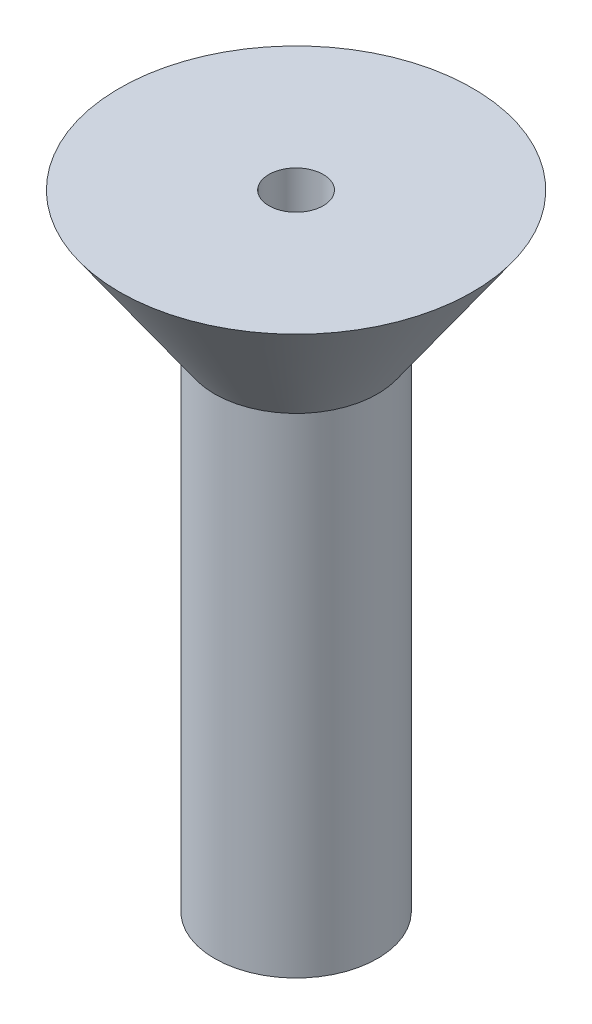
ISO-10303-21;
HEADER;
FILE_DESCRIPTION(('STEP AP214'),'2;1');
FILE_NAME('part.step','',(''),(''),'','','');
FILE_SCHEMA(('AUTOMOTIVE_DESIGN { 1 0 10303 214 1 1 1 1 }'));
ENDSEC;
DATA;
#1=APPLICATION_CONTEXT('core data for automotive mechanical design processes');
#2=APPLICATION_PROTOCOL_DEFINITION('international standard','automotive_design',2000,#1);
#3=PRODUCT_CONTEXT('',#1,'mechanical');
#4=PRODUCT('Part','Part','',(#3));
#5=PRODUCT_RELATED_PRODUCT_CATEGORY('part','',(#4));
#6=PRODUCT_DEFINITION_FORMATION('','',#4);
#7=PRODUCT_DEFINITION_CONTEXT('part definition',#1,'design');
#8=PRODUCT_DEFINITION('design','',#6,#7);
#9=PRODUCT_DEFINITION_SHAPE('','',#8);
#10=(LENGTH_UNIT() NAMED_UNIT(*) SI_UNIT(.MILLI.,.METRE.));
#11=(NAMED_UNIT(*) PLANE_ANGLE_UNIT() SI_UNIT($,.RADIAN.));
#12=(NAMED_UNIT(*) SI_UNIT($,.STERADIAN.) SOLID_ANGLE_UNIT());
#13=UNCERTAINTY_MEASURE_WITH_UNIT(LENGTH_MEASURE(1.E-05),#10,'distance_accuracy_value','');
#14=(GEOMETRIC_REPRESENTATION_CONTEXT(3) GLOBAL_UNCERTAINTY_ASSIGNED_CONTEXT((#13)) GLOBAL_UNIT_ASSIGNED_CONTEXT((#10,
#11,#12)) REPRESENTATION_CONTEXT('',''));
#15=CARTESIAN_POINT('',(0.,0.,0.));
#16=DIRECTION('',(0.,0.,1.));
#17=DIRECTION('',(1.,0.,0.));
#18=AXIS2_PLACEMENT_3D('',#15,#16,#17);
#19=CARTESIAN_POINT('',(0.,21.,0.));
#20=DIRECTION('',(0.,-1.,0.));
#21=DIRECTION('',(0.,0.,-1.));
#22=AXIS2_PLACEMENT_3D('',#19,#20,#21);
#23=PLANE('',#22);
#24=CARTESIAN_POINT('',(0.,21.,0.));
#25=DIRECTION('',(0.,1.,0.));
#26=DIRECTION('',(0.,0.,1.));
#27=AXIS2_PLACEMENT_3D('',#24,#25,#26);
#28=CIRCLE('',#27,0.999999999999991);
#29=CARTESIAN_POINT('',(0.,21.,0.999999999999991));
#30=VERTEX_POINT('',#29);
#31=EDGE_CURVE('E11',#30,#30,#28,.T.);
#32=ORIENTED_EDGE('',*,*,#31,.T.);
#33=EDGE_LOOP('',(#32));
#34=FACE_BOUND('',#33,.T.);
#35=ADVANCED_FACE('F44',(#34),#23,.F.);
#36=CARTESIAN_POINT('',(0.,91.9213442846911,0.));
#37=DIRECTION('',(0.,1.,0.));
#38=DIRECTION('',(0.,0.,1.));
#39=AXIS2_PLACEMENT_3D('',#36,#37,#38);
#40=CYLINDRICAL_SURFACE('',#39,0.999999999999991);
#41=ORIENTED_EDGE('',*,*,#31,.F.);
#42=EDGE_LOOP('',(#41));
#43=FACE_BOUND('',#42,.T.);
#44=CARTESIAN_POINT('',(0.,23.,0.));
#45=DIRECTION('',(0.,1.,0.));
#46=DIRECTION('',(0.,0.,1.));
#47=AXIS2_PLACEMENT_3D('',#44,#45,#46);
#48=CIRCLE('',#47,0.999999999999991);
#49=CARTESIAN_POINT('',(0.,23.,0.999999999999991));
#50=VERTEX_POINT('',#49);
#51=EDGE_CURVE('E51',#50,#50,#48,.T.);
#52=ORIENTED_EDGE('',*,*,#51,.T.);
#53=EDGE_LOOP('',(#52));
#54=FACE_BOUND('',#53,.T.);
#55=ADVANCED_FACE('F77',(#43,#54),#40,.F.);
#56=CARTESIAN_POINT('',(0.,23.,0.));
#57=DIRECTION('',(0.,-1.,0.));
#58=DIRECTION('',(0.,0.,-1.));
#59=AXIS2_PLACEMENT_3D('',#56,#57,#58);
#60=PLANE('',#59);
#61=ORIENTED_EDGE('',*,*,#51,.F.);
#62=EDGE_LOOP('',(#61));
#63=FACE_BOUND('',#62,.T.);
#64=CARTESIAN_POINT('',(0.,23.,0.));
#65=DIRECTION('',(0.,1.,0.));
#66=DIRECTION('',(0.,0.,1.));
#67=AXIS2_PLACEMENT_3D('',#64,#65,#66);
#68=CIRCLE('',#67,6.49999999999999);
#69=CARTESIAN_POINT('',(0.,23.,6.49999999999999));
#70=VERTEX_POINT('',#69);
#71=EDGE_CURVE('E68',#70,#70,#68,.T.);
#72=ORIENTED_EDGE('',*,*,#71,.T.);
#73=EDGE_LOOP('',(#72));
#74=FACE_BOUND('',#73,.T.);
#75=ADVANCED_FACE('F79',(#63,#74),#60,.F.);
#76=CARTESIAN_POINT('',(0.,18.,0.));
#77=DIRECTION('',(0.,1.,0.));
#78=DIRECTION('',(0.,0.,1.));
#79=AXIS2_PLACEMENT_3D('',#76,#77,#78);
#80=CONICAL_SURFACE('',#79,3.,0.610725964389207);
#81=ORIENTED_EDGE('',*,*,#71,.F.);
#82=EDGE_LOOP('',(#81));
#83=FACE_BOUND('',#82,.T.);
#84=CARTESIAN_POINT('',(0.,18.,0.));
#85=DIRECTION('',(0.,1.,0.));
#86=DIRECTION('',(0.,0.,1.));
#87=AXIS2_PLACEMENT_3D('',#84,#85,#86);
#88=CIRCLE('',#87,3.);
#89=CARTESIAN_POINT('',(0.,18.,3.));
#90=VERTEX_POINT('',#89);
#91=EDGE_CURVE('E64',#90,#90,#88,.T.);
#92=ORIENTED_EDGE('',*,*,#91,.T.);
#93=EDGE_LOOP('',(#92));
#94=FACE_BOUND('',#93,.T.);
#95=ADVANCED_FACE('F82',(#83,#94),#80,.T.);
#96=CARTESIAN_POINT('',(0.,91.9213442846911,0.));
#97=DIRECTION('',(0.,1.,0.));
#98=DIRECTION('',(0.,0.,1.));
#99=AXIS2_PLACEMENT_3D('',#96,#97,#98);
#100=CYLINDRICAL_SURFACE('',#99,3.);
#101=ORIENTED_EDGE('',*,*,#91,.F.);
#102=EDGE_LOOP('',(#101));
#103=FACE_BOUND('',#102,.T.);
#104=CARTESIAN_POINT('',(0.,0.,0.));
#105=DIRECTION('',(0.,1.,0.));
#106=DIRECTION('',(0.,0.,1.));
#107=AXIS2_PLACEMENT_3D('',#104,#105,#106);
#108=CIRCLE('',#107,3.);
#109=CARTESIAN_POINT('',(0.,0.,3.));
#110=VERTEX_POINT('',#109);
#111=EDGE_CURVE('E61',#110,#110,#108,.T.);
#112=ORIENTED_EDGE('',*,*,#111,.T.);
#113=EDGE_LOOP('',(#112));
#114=FACE_BOUND('',#113,.T.);
#115=ADVANCED_FACE('F57',(#103,#114),#100,.T.);
#116=CARTESIAN_POINT('',(0.,0.,0.));
#117=DIRECTION('',(0.,1.,0.));
#118=DIRECTION('',(0.,0.,1.));
#119=AXIS2_PLACEMENT_3D('',#116,#117,#118);
#120=CONICAL_SURFACE('',#119,3.,1.0471975511966);
#121=CARTESIAN_POINT('',(0.,-1.73205080756887,0.));
#122=VERTEX_POINT('',#121);
#123=VERTEX_LOOP('',#122);
#124=FACE_BOUND('',#123,.T.);
#125=ORIENTED_EDGE('',*,*,#111,.F.);
#126=EDGE_LOOP('',(#125));
#127=FACE_BOUND('',#126,.T.);
#128=ADVANCED_FACE('F54',(#124,#127),#120,.T.);
#129=CLOSED_SHELL('',(#35,#55,#75,#95,#115,#128));
#130=MANIFOLD_SOLID_BREP('B2',#129);
#131=ADVANCED_BREP_SHAPE_REPRESENTATION('',(#18,#130),#14);
#132=SHAPE_DEFINITION_REPRESENTATION(#9,#131);
ENDSEC;
END-ISO-10303-21;
